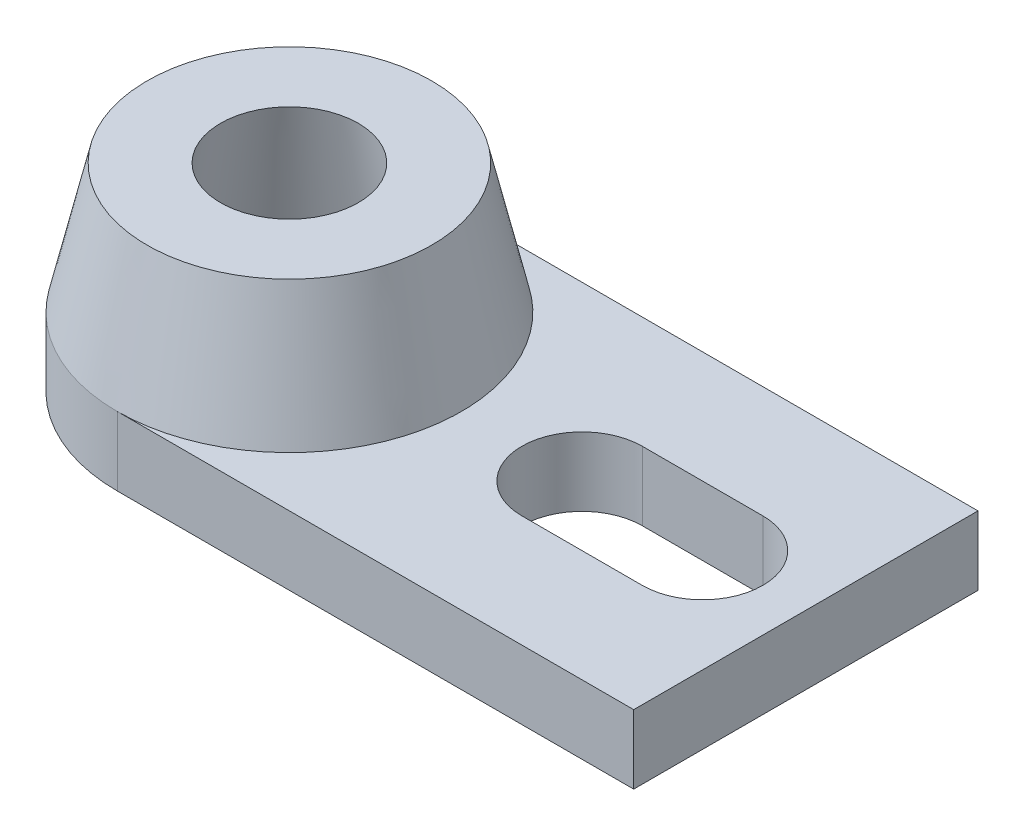
ISO-10303-21;
HEADER;
FILE_DESCRIPTION(('STEP AP214'),'2;1');
FILE_NAME('part.step','',(''),(''),'','','');
FILE_SCHEMA(('AUTOMOTIVE_DESIGN { 1 0 10303 214 1 1 1 1 }'));
ENDSEC;
DATA;
#1=APPLICATION_CONTEXT('core data for automotive mechanical design processes');
#2=APPLICATION_PROTOCOL_DEFINITION('international standard','automotive_design',2000,#1);
#3=PRODUCT_CONTEXT('',#1,'mechanical');
#4=PRODUCT('Part','Part','',(#3));
#5=PRODUCT_RELATED_PRODUCT_CATEGORY('part','',(#4));
#6=PRODUCT_DEFINITION_FORMATION('','',#4);
#7=PRODUCT_DEFINITION_CONTEXT('part definition',#1,'design');
#8=PRODUCT_DEFINITION('design','',#6,#7);
#9=PRODUCT_DEFINITION_SHAPE('','',#8);
#10=(LENGTH_UNIT() NAMED_UNIT(*) SI_UNIT(.MILLI.,.METRE.));
#11=(NAMED_UNIT(*) PLANE_ANGLE_UNIT() SI_UNIT($,.RADIAN.));
#12=(NAMED_UNIT(*) SI_UNIT($,.STERADIAN.) SOLID_ANGLE_UNIT());
#13=UNCERTAINTY_MEASURE_WITH_UNIT(LENGTH_MEASURE(1.E-05),#10,'distance_accuracy_value','');
#14=(GEOMETRIC_REPRESENTATION_CONTEXT(3) GLOBAL_UNCERTAINTY_ASSIGNED_CONTEXT((#13)) GLOBAL_UNIT_ASSIGNED_CONTEXT((#10,
#11,#12)) REPRESENTATION_CONTEXT('',''));
#15=CARTESIAN_POINT('',(0.,0.,0.));
#16=DIRECTION('',(0.,0.,1.));
#17=DIRECTION('',(1.,0.,0.));
#18=AXIS2_PLACEMENT_3D('',#15,#16,#17);
#19=CARTESIAN_POINT('',(-60.,8.,-20.));
#20=DIRECTION('',(0.,-1.,0.));
#21=DIRECTION('',(0.,0.,-1.));
#22=AXIS2_PLACEMENT_3D('',#19,#20,#21);
#23=PLANE('',#22);
#24=DIRECTION('',(1.,0.,0.));
#25=VECTOR('',#24,1.);
#26=CARTESIAN_POINT('',(-60.,8.,0.));
#27=LINE('',#26,#25);
#28=CARTESIAN_POINT('',(-60.,8.,0.));
#29=VERTEX_POINT('',#28);
#30=CARTESIAN_POINT('',(0.,8.,0.));
#31=VERTEX_POINT('',#30);
#32=EDGE_CURVE('E118',#29,#31,#27,.T.);
#33=ORIENTED_EDGE('',*,*,#32,.T.);
#34=DIRECTION('',(0.,0.,-1.));
#35=VECTOR('',#34,1.);
#36=CARTESIAN_POINT('',(0.,8.,0.));
#37=LINE('',#36,#35);
#38=CARTESIAN_POINT('',(0.,8.,-40.));
#39=VERTEX_POINT('',#38);
#40=EDGE_CURVE('E162',#31,#39,#37,.T.);
#41=ORIENTED_EDGE('',*,*,#40,.T.);
#42=DIRECTION('',(-1.,0.,0.));
#43=VECTOR('',#42,1.);
#44=CARTESIAN_POINT('',(0.,8.,-40.));
#45=LINE('',#44,#43);
#46=CARTESIAN_POINT('',(-60.,8.,-40.));
#47=VERTEX_POINT('',#46);
#48=EDGE_CURVE('E165',#39,#47,#45,.T.);
#49=ORIENTED_EDGE('',*,*,#48,.T.);
#50=CARTESIAN_POINT('',(-60.,8.,-20.));
#51=DIRECTION('',(0.,-1.,0.));
#52=DIRECTION('',(0.,0.,-1.));
#53=AXIS2_PLACEMENT_3D('',#50,#51,#52);
#54=CIRCLE('',#53,20.);
#55=EDGE_CURVE('E123',#47,#29,#54,.T.);
#56=ORIENTED_EDGE('',*,*,#55,.T.);
#57=EDGE_LOOP('',(#33,#41,#49,#56));
#58=FACE_BOUND('',#57,.T.);
#59=CARTESIAN_POINT('',(-26.,8.,-20.));
#60=DIRECTION('',(0.,1.,0.));
#61=DIRECTION('',(0.,0.,1.));
#62=AXIS2_PLACEMENT_3D('',#59,#60,#61);
#63=CIRCLE('',#62,7.);
#64=CARTESIAN_POINT('',(-26.,8.,-27.));
#65=VERTEX_POINT('',#64);
#66=CARTESIAN_POINT('',(-26.,8.,-13.));
#67=VERTEX_POINT('',#66);
#68=EDGE_CURVE('E137',#65,#67,#63,.T.);
#69=ORIENTED_EDGE('',*,*,#68,.F.);
#70=DIRECTION('',(-1.,0.,0.));
#71=VECTOR('',#70,1.);
#72=CARTESIAN_POINT('',(-26.,8.,-27.));
#73=LINE('',#72,#71);
#74=CARTESIAN_POINT('',(-12.,8.,-27.));
#75=VERTEX_POINT('',#74);
#76=EDGE_CURVE('E144',#75,#65,#73,.T.);
#77=ORIENTED_EDGE('',*,*,#76,.F.);
#78=CARTESIAN_POINT('',(-12.,8.,-20.));
#79=DIRECTION('',(0.,1.,0.));
#80=DIRECTION('',(0.,0.,1.));
#81=AXIS2_PLACEMENT_3D('',#78,#79,#80);
#82=CIRCLE('',#81,7.);
#83=CARTESIAN_POINT('',(-12.,8.,-13.));
#84=VERTEX_POINT('',#83);
#85=EDGE_CURVE('E142',#84,#75,#82,.T.);
#86=ORIENTED_EDGE('',*,*,#85,.F.);
#87=DIRECTION('',(1.,0.,0.));
#88=VECTOR('',#87,1.);
#89=CARTESIAN_POINT('',(-26.,8.,-13.));
#90=LINE('',#89,#88);
#91=EDGE_CURVE('E139',#67,#84,#90,.T.);
#92=ORIENTED_EDGE('',*,*,#91,.F.);
#93=EDGE_LOOP('',(#69,#77,#86,#92));
#94=FACE_BOUND('',#93,.T.);
#95=ADVANCED_FACE('F35',(#58,#94),#23,.F.);
#96=CARTESIAN_POINT('',(-60.,0.,-20.));
#97=DIRECTION('',(0.,-1.,0.));
#98=DIRECTION('',(0.,0.,-1.));
#99=AXIS2_PLACEMENT_3D('',#96,#97,#98);
#100=PLANE('',#99);
#101=DIRECTION('',(1.,0.,0.));
#102=VECTOR('',#101,1.);
#103=CARTESIAN_POINT('',(-60.,0.,0.));
#104=LINE('',#103,#102);
#105=CARTESIAN_POINT('',(-60.,0.,0.));
#106=VERTEX_POINT('',#105);
#107=CARTESIAN_POINT('',(0.,0.,0.));
#108=VERTEX_POINT('',#107);
#109=EDGE_CURVE('E102',#106,#108,#104,.T.);
#110=ORIENTED_EDGE('',*,*,#109,.F.);
#111=CARTESIAN_POINT('',(-60.,0.,-20.));
#112=DIRECTION('',(0.,-1.,0.));
#113=DIRECTION('',(0.,0.,-1.));
#114=AXIS2_PLACEMENT_3D('',#111,#112,#113);
#115=CIRCLE('',#114,20.);
#116=CARTESIAN_POINT('',(-60.,0.,-40.));
#117=VERTEX_POINT('',#116);
#118=EDGE_CURVE('E108',#106,#117,#115,.T.);
#119=ORIENTED_EDGE('',*,*,#118,.T.);
#120=DIRECTION('',(-1.,0.,0.));
#121=VECTOR('',#120,1.);
#122=CARTESIAN_POINT('',(0.,0.,-40.));
#123=LINE('',#122,#121);
#124=CARTESIAN_POINT('',(0.,0.,-40.));
#125=VERTEX_POINT('',#124);
#126=EDGE_CURVE('E163',#125,#117,#123,.T.);
#127=ORIENTED_EDGE('',*,*,#126,.F.);
#128=DIRECTION('',(0.,0.,-1.));
#129=VECTOR('',#128,1.);
#130=CARTESIAN_POINT('',(0.,0.,0.));
#131=LINE('',#130,#129);
#132=EDGE_CURVE('E109',#108,#125,#131,.T.);
#133=ORIENTED_EDGE('',*,*,#132,.F.);
#134=EDGE_LOOP('',(#110,#119,#127,#133));
#135=FACE_BOUND('',#134,.T.);
#136=DIRECTION('',(-1.,0.,0.));
#137=VECTOR('',#136,1.);
#138=CARTESIAN_POINT('',(-26.,0.,-27.));
#139=LINE('',#138,#137);
#140=CARTESIAN_POINT('',(-12.,0.,-27.));
#141=VERTEX_POINT('',#140);
#142=CARTESIAN_POINT('',(-26.,0.,-27.));
#143=VERTEX_POINT('',#142);
#144=EDGE_CURVE('E140',#141,#143,#139,.T.);
#145=ORIENTED_EDGE('',*,*,#144,.T.);
#146=CARTESIAN_POINT('',(-26.,0.,-20.));
#147=DIRECTION('',(0.,1.,0.));
#148=DIRECTION('',(0.,0.,1.));
#149=AXIS2_PLACEMENT_3D('',#146,#147,#148);
#150=CIRCLE('',#149,7.);
#151=CARTESIAN_POINT('',(-26.,0.,-13.));
#152=VERTEX_POINT('',#151);
#153=EDGE_CURVE('E58',#143,#152,#150,.T.);
#154=ORIENTED_EDGE('',*,*,#153,.T.);
#155=DIRECTION('',(1.,0.,0.));
#156=VECTOR('',#155,1.);
#157=CARTESIAN_POINT('',(-26.,0.,-13.));
#158=LINE('',#157,#156);
#159=CARTESIAN_POINT('',(-12.,0.,-13.));
#160=VERTEX_POINT('',#159);
#161=EDGE_CURVE('E148',#152,#160,#158,.T.);
#162=ORIENTED_EDGE('',*,*,#161,.T.);
#163=CARTESIAN_POINT('',(-12.,0.,-20.));
#164=DIRECTION('',(0.,1.,0.));
#165=DIRECTION('',(0.,0.,1.));
#166=AXIS2_PLACEMENT_3D('',#163,#164,#165);
#167=CIRCLE('',#166,7.);
#168=EDGE_CURVE('E151',#160,#141,#167,.T.);
#169=ORIENTED_EDGE('',*,*,#168,.T.);
#170=EDGE_LOOP('',(#145,#154,#162,#169));
#171=FACE_BOUND('',#170,.T.);
#172=CARTESIAN_POINT('',(-60.,0.,-20.));
#173=DIRECTION('',(0.,-1.,0.));
#174=DIRECTION('',(0.,0.,-1.));
#175=AXIS2_PLACEMENT_3D('',#172,#173,#174);
#176=CIRCLE('',#175,12.0555205562947);
#177=CARTESIAN_POINT('',(-60.,0.,-32.0555205562947));
#178=VERTEX_POINT('',#177);
#179=EDGE_CURVE('E129',#178,#178,#176,.T.);
#180=ORIENTED_EDGE('',*,*,#179,.F.);
#181=EDGE_LOOP('',(#180));
#182=FACE_BOUND('',#181,.T.);
#183=ADVANCED_FACE('F104',(#135,#171,#182),#100,.T.);
#184=CARTESIAN_POINT('',(-60.,8.,0.));
#185=DIRECTION('',(0.,0.,-1.));
#186=DIRECTION('',(-1.,0.,0.));
#187=AXIS2_PLACEMENT_3D('',#184,#185,#186);
#188=PLANE('',#187);
#189=ORIENTED_EDGE('',*,*,#109,.T.);
#190=DIRECTION('',(0.,-1.,0.));
#191=VECTOR('',#190,1.);
#192=CARTESIAN_POINT('',(0.,8.,0.));
#193=LINE('',#192,#191);
#194=EDGE_CURVE('E11',#31,#108,#193,.T.);
#195=ORIENTED_EDGE('',*,*,#194,.F.);
#196=ORIENTED_EDGE('',*,*,#32,.F.);
#197=DIRECTION('',(0.,-1.,0.));
#198=VECTOR('',#197,1.);
#199=CARTESIAN_POINT('',(-60.,8.,0.));
#200=LINE('',#199,#198);
#201=EDGE_CURVE('E116',#29,#106,#200,.T.);
#202=ORIENTED_EDGE('',*,*,#201,.T.);
#203=EDGE_LOOP('',(#189,#195,#196,#202));
#204=FACE_BOUND('',#203,.T.);
#205=ADVANCED_FACE('F37',(#204),#188,.F.);
#206=CARTESIAN_POINT('',(0.,8.,0.));
#207=DIRECTION('',(-1.,0.,0.));
#208=DIRECTION('',(0.,0.,1.));
#209=AXIS2_PLACEMENT_3D('',#206,#207,#208);
#210=PLANE('',#209);
#211=ORIENTED_EDGE('',*,*,#132,.T.);
#212=DIRECTION('',(0.,-1.,0.));
#213=VECTOR('',#212,1.);
#214=CARTESIAN_POINT('',(0.,8.,-40.));
#215=LINE('',#214,#213);
#216=EDGE_CURVE('E43',#39,#125,#215,.T.);
#217=ORIENTED_EDGE('',*,*,#216,.F.);
#218=ORIENTED_EDGE('',*,*,#40,.F.);
#219=ORIENTED_EDGE('',*,*,#194,.T.);
#220=EDGE_LOOP('',(#211,#217,#218,#219));
#221=FACE_BOUND('',#220,.T.);
#222=ADVANCED_FACE('F176',(#221),#210,.F.);
#223=CARTESIAN_POINT('',(0.,8.,-40.));
#224=DIRECTION('',(0.,0.,1.));
#225=DIRECTION('',(1.,0.,0.));
#226=AXIS2_PLACEMENT_3D('',#223,#224,#225);
#227=PLANE('',#226);
#228=ORIENTED_EDGE('',*,*,#126,.T.);
#229=DIRECTION('',(0.,-1.,0.));
#230=VECTOR('',#229,1.);
#231=CARTESIAN_POINT('',(-60.,8.,-40.));
#232=LINE('',#231,#230);
#233=EDGE_CURVE('E122',#47,#117,#232,.T.);
#234=ORIENTED_EDGE('',*,*,#233,.F.);
#235=ORIENTED_EDGE('',*,*,#48,.F.);
#236=ORIENTED_EDGE('',*,*,#216,.T.);
#237=EDGE_LOOP('',(#228,#234,#235,#236));
#238=FACE_BOUND('',#237,.T.);
#239=ADVANCED_FACE('F174',(#238),#227,.F.);
#240=CARTESIAN_POINT('',(-26.,8.,-20.));
#241=DIRECTION('',(0.,-1.,0.));
#242=DIRECTION('',(0.,0.,-1.));
#243=AXIS2_PLACEMENT_3D('',#240,#241,#242);
#244=CYLINDRICAL_SURFACE('',#243,7.);
#245=ORIENTED_EDGE('',*,*,#153,.F.);
#246=DIRECTION('',(0.,-1.,0.));
#247=VECTOR('',#246,1.);
#248=CARTESIAN_POINT('',(-26.,8.,-27.));
#249=LINE('',#248,#247);
#250=EDGE_CURVE('E146',#65,#143,#249,.T.);
#251=ORIENTED_EDGE('',*,*,#250,.F.);
#252=ORIENTED_EDGE('',*,*,#68,.T.);
#253=DIRECTION('',(0.,-1.,0.));
#254=VECTOR('',#253,1.);
#255=CARTESIAN_POINT('',(-26.,8.,-13.));
#256=LINE('',#255,#254);
#257=EDGE_CURVE('E112',#67,#152,#256,.T.);
#258=ORIENTED_EDGE('',*,*,#257,.T.);
#259=EDGE_LOOP('',(#245,#251,#252,#258));
#260=FACE_BOUND('',#259,.T.);
#261=ADVANCED_FACE('F211',(#260),#244,.F.);
#262=CARTESIAN_POINT('',(-26.,8.,-13.));
#263=DIRECTION('',(0.,0.,-1.));
#264=DIRECTION('',(-1.,0.,0.));
#265=AXIS2_PLACEMENT_3D('',#262,#263,#264);
#266=PLANE('',#265);
#267=ORIENTED_EDGE('',*,*,#161,.F.);
#268=ORIENTED_EDGE('',*,*,#257,.F.);
#269=ORIENTED_EDGE('',*,*,#91,.T.);
#270=DIRECTION('',(0.,-1.,0.));
#271=VECTOR('',#270,1.);
#272=CARTESIAN_POINT('',(-12.,8.,-13.));
#273=LINE('',#272,#271);
#274=EDGE_CURVE('E158',#84,#160,#273,.T.);
#275=ORIENTED_EDGE('',*,*,#274,.T.);
#276=EDGE_LOOP('',(#267,#268,#269,#275));
#277=FACE_BOUND('',#276,.T.);
#278=ADVANCED_FACE('F228',(#277),#266,.T.);
#279=CARTESIAN_POINT('',(-12.,8.,-20.));
#280=DIRECTION('',(0.,-1.,0.));
#281=DIRECTION('',(0.,0.,-1.));
#282=AXIS2_PLACEMENT_3D('',#279,#280,#281);
#283=CYLINDRICAL_SURFACE('',#282,7.);
#284=ORIENTED_EDGE('',*,*,#168,.F.);
#285=ORIENTED_EDGE('',*,*,#274,.F.);
#286=ORIENTED_EDGE('',*,*,#85,.T.);
#287=DIRECTION('',(0.,-1.,0.));
#288=VECTOR('',#287,1.);
#289=CARTESIAN_POINT('',(-12.,8.,-27.));
#290=LINE('',#289,#288);
#291=EDGE_CURVE('E50',#75,#141,#290,.T.);
#292=ORIENTED_EDGE('',*,*,#291,.T.);
#293=EDGE_LOOP('',(#284,#285,#286,#292));
#294=FACE_BOUND('',#293,.T.);
#295=ADVANCED_FACE('F234',(#294),#283,.F.);
#296=CARTESIAN_POINT('',(-26.,8.,-27.));
#297=DIRECTION('',(0.,0.,1.));
#298=DIRECTION('',(1.,0.,0.));
#299=AXIS2_PLACEMENT_3D('',#296,#297,#298);
#300=PLANE('',#299);
#301=ORIENTED_EDGE('',*,*,#144,.F.);
#302=ORIENTED_EDGE('',*,*,#291,.F.);
#303=ORIENTED_EDGE('',*,*,#76,.T.);
#304=ORIENTED_EDGE('',*,*,#250,.T.);
#305=EDGE_LOOP('',(#301,#302,#303,#304));
#306=FACE_BOUND('',#305,.T.);
#307=ADVANCED_FACE('F242',(#306),#300,.T.);
#308=CARTESIAN_POINT('',(-60.,-24.63831279771,-20.));
#309=DIRECTION('',(0.,-1.,0.));
#310=DIRECTION('',(0.,0.,-1.));
#311=AXIS2_PLACEMENT_3D('',#308,#309,#310);
#312=CYLINDRICAL_SURFACE('',#311,20.);
#313=ORIENTED_EDGE('',*,*,#118,.F.);
#314=ORIENTED_EDGE('',*,*,#201,.F.);
#315=CARTESIAN_POINT('',(-60.,8.,-20.));
#316=DIRECTION('',(0.,-1.,0.));
#317=DIRECTION('',(0.,0.,-1.));
#318=AXIS2_PLACEMENT_3D('',#315,#316,#317);
#319=CIRCLE('',#318,20.);
#320=EDGE_CURVE('E128',#29,#47,#319,.T.);
#321=ORIENTED_EDGE('',*,*,#320,.T.);
#322=ORIENTED_EDGE('',*,*,#233,.T.);
#323=EDGE_LOOP('',(#313,#314,#321,#322));
#324=FACE_BOUND('',#323,.T.);
#325=ADVANCED_FACE('F126',(#324),#312,.T.);
#326=CARTESIAN_POINT('',(-60.,23.,-20.));
#327=DIRECTION('',(0.,-1.,0.));
#328=DIRECTION('',(0.,0.,-1.));
#329=AXIS2_PLACEMENT_3D('',#326,#327,#328);
#330=CONICAL_SURFACE('',#329,16.5369771331167,0.226892802759256);
#331=ORIENTED_EDGE('',*,*,#55,.F.);
#332=ORIENTED_EDGE('',*,*,#320,.F.);
#333=EDGE_LOOP('',(#331,#332));
#334=FACE_BOUND('',#333,.T.);
#335=CARTESIAN_POINT('',(-60.,23.,-20.));
#336=DIRECTION('',(0.,-1.,0.));
#337=DIRECTION('',(0.,0.,-1.));
#338=AXIS2_PLACEMENT_3D('',#335,#336,#337);
#339=CIRCLE('',#338,16.5369771331167);
#340=CARTESIAN_POINT('',(-60.,23.,-36.5369771331167));
#341=VERTEX_POINT('',#340);
#342=EDGE_CURVE('E188',#341,#341,#339,.T.);
#343=ORIENTED_EDGE('',*,*,#342,.T.);
#344=EDGE_LOOP('',(#343));
#345=FACE_BOUND('',#344,.T.);
#346=ADVANCED_FACE('F181',(#334,#345),#330,.T.);
#347=CARTESIAN_POINT('',(-60.,0.,-20.));
#348=DIRECTION('',(0.,-1.,0.));
#349=DIRECTION('',(0.,0.,-1.));
#350=AXIS2_PLACEMENT_3D('',#347,#348,#349);
#351=CONICAL_SURFACE('',#350,12.0555205562947,0.174532925199433);
#352=CARTESIAN_POINT('',(-60.,23.,-20.));
#353=DIRECTION('',(0.,-1.,0.));
#354=DIRECTION('',(0.,0.,-1.));
#355=AXIS2_PLACEMENT_3D('',#352,#353,#354);
#356=CIRCLE('',#355,8.00000000000001);
#357=CARTESIAN_POINT('',(-60.,23.,-28.));
#358=VERTEX_POINT('',#357);
#359=EDGE_CURVE('E133',#358,#358,#356,.T.);
#360=ORIENTED_EDGE('',*,*,#359,.F.);
#361=EDGE_LOOP('',(#360));
#362=FACE_BOUND('',#361,.T.);
#363=ORIENTED_EDGE('',*,*,#179,.T.);
#364=EDGE_LOOP('',(#363));
#365=FACE_BOUND('',#364,.T.);
#366=ADVANCED_FACE('F184',(#362,#365),#351,.F.);
#367=CARTESIAN_POINT('',(-68.,23.,-20.));
#368=DIRECTION('',(0.,-1.,0.));
#369=DIRECTION('',(0.,0.,-1.));
#370=AXIS2_PLACEMENT_3D('',#367,#368,#369);
#371=PLANE('',#370);
#372=ORIENTED_EDGE('',*,*,#342,.F.);
#373=EDGE_LOOP('',(#372));
#374=FACE_BOUND('',#373,.T.);
#375=ORIENTED_EDGE('',*,*,#359,.T.);
#376=EDGE_LOOP('',(#375));
#377=FACE_BOUND('',#376,.T.);
#378=ADVANCED_FACE('F194',(#374,#377),#371,.F.);
#379=CLOSED_SHELL('',(#95,#183,#205,#222,#239,#261,#278,#295,#307,#325,#346,#366,#378));
#380=MANIFOLD_SOLID_BREP('B2',#379);
#381=ADVANCED_BREP_SHAPE_REPRESENTATION('',(#18,#380),#14);
#382=SHAPE_DEFINITION_REPRESENTATION(#9,#381);
ENDSEC;
END-ISO-10303-21;
